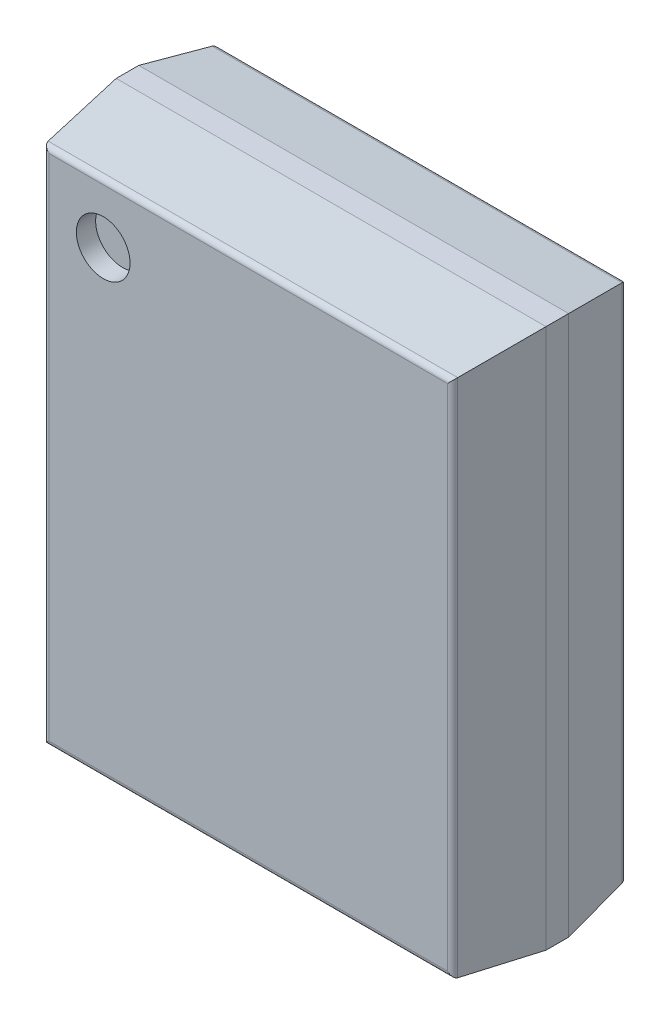
ISO-10303-21;
HEADER;
FILE_DESCRIPTION(('STEP AP214'),'2;1');
FILE_NAME('part.step','',(''),(''),'','','');
FILE_SCHEMA(('AUTOMOTIVE_DESIGN { 1 0 10303 214 1 1 1 1 }'));
ENDSEC;
DATA;
#1=APPLICATION_CONTEXT('core data for automotive mechanical design processes');
#2=APPLICATION_PROTOCOL_DEFINITION('international standard','automotive_design',2000,#1);
#3=PRODUCT_CONTEXT('',#1,'mechanical');
#4=PRODUCT('Part','Part','',(#3));
#5=PRODUCT_RELATED_PRODUCT_CATEGORY('part','',(#4));
#6=PRODUCT_DEFINITION_FORMATION('','',#4);
#7=PRODUCT_DEFINITION_CONTEXT('part definition',#1,'design');
#8=PRODUCT_DEFINITION('design','',#6,#7);
#9=PRODUCT_DEFINITION_SHAPE('','',#8);
#10=(LENGTH_UNIT() NAMED_UNIT(*) SI_UNIT(.MILLI.,.METRE.));
#11=(NAMED_UNIT(*) PLANE_ANGLE_UNIT() SI_UNIT($,.RADIAN.));
#12=(NAMED_UNIT(*) SI_UNIT($,.STERADIAN.) SOLID_ANGLE_UNIT());
#13=UNCERTAINTY_MEASURE_WITH_UNIT(LENGTH_MEASURE(1.E-05),#10,'distance_accuracy_value','');
#14=(GEOMETRIC_REPRESENTATION_CONTEXT(3) GLOBAL_UNCERTAINTY_ASSIGNED_CONTEXT((#13)) GLOBAL_UNIT_ASSIGNED_CONTEXT((#10,
#11,#12)) REPRESENTATION_CONTEXT('',''));
#15=CARTESIAN_POINT('',(0.,0.,0.));
#16=DIRECTION('',(0.,0.,1.));
#17=DIRECTION('',(1.,0.,0.));
#18=AXIS2_PLACEMENT_3D('',#15,#16,#17);
#19=CARTESIAN_POINT('',(-1.315,1.815,1.575));
#20=DIRECTION('',(0.,0.,1.));
#21=DIRECTION('',(1.,0.,0.));
#22=AXIS2_PLACEMENT_3D('',#19,#20,#21);
#23=PLANE('',#22);
#24=CARTESIAN_POINT('',(-1.315,1.815,1.575));
#25=DIRECTION('',(0.,0.,1.));
#26=DIRECTION('',(1.,0.,0.));
#27=AXIS2_PLACEMENT_3D('',#24,#25,#26);
#28=CIRCLE('',#27,0.24375);
#29=CARTESIAN_POINT('',(-1.07125,1.815,1.575));
#30=VERTEX_POINT('',#29);
#31=EDGE_CURVE('E11',#30,#30,#28,.T.);
#32=ORIENTED_EDGE('',*,*,#31,.T.);
#33=EDGE_LOOP('',(#32));
#34=FACE_BOUND('',#33,.T.);
#35=ADVANCED_FACE('F17',(#34),#23,.T.);
#36=CARTESIAN_POINT('',(-1.315,1.815,1.575));
#37=DIRECTION('',(0.,0.,1.));
#38=DIRECTION('',(1.,0.,0.));
#39=AXIS2_PLACEMENT_3D('',#36,#37,#38);
#40=CYLINDRICAL_SURFACE('',#39,0.24375);
#41=CARTESIAN_POINT('',(-1.315,1.815,1.75));
#42=DIRECTION('',(0.,0.,1.));
#43=DIRECTION('',(1.,0.,0.));
#44=AXIS2_PLACEMENT_3D('',#41,#42,#43);
#45=CIRCLE('',#44,0.24375);
#46=CARTESIAN_POINT('',(-1.07125,1.815,1.75));
#47=VERTEX_POINT('',#46);
#48=EDGE_CURVE('E219',#47,#47,#45,.T.);
#49=ORIENTED_EDGE('',*,*,#48,.T.);
#50=EDGE_LOOP('',(#49));
#51=FACE_BOUND('',#50,.T.);
#52=ORIENTED_EDGE('',*,*,#31,.F.);
#53=EDGE_LOOP('',(#52));
#54=FACE_BOUND('',#53,.T.);
#55=ADVANCED_FACE('F19',(#51,#54),#40,.F.);
#56=CARTESIAN_POINT('',(1.808558552786,-2.3525,1.7));
#57=DIRECTION('',(0.,1.,0.));
#58=DIRECTION('',(0.,0.,1.));
#59=AXIS2_PLACEMENT_3D('',#56,#57,#58);
#60=CYLINDRICAL_SURFACE('',#59,0.05);
#61=CARTESIAN_POINT('',(1.808558552786,-2.308558552786,1.7));
#62=DIRECTION('',(-0.707106781186548,-0.707106781186548,0.));
#63=DIRECTION('',(0.707106781186548,-0.707106781186548,0.));
#64=AXIS2_PLACEMENT_3D('',#61,#62,#63);
#65=ELLIPSE('',#64,0.07071067811865,0.05);
#66=CARTESIAN_POINT('',(1.858144342698,-2.358144342698,1.706422572601));
#67=VERTEX_POINT('',#66);
#68=CARTESIAN_POINT('',(1.808558552786,-2.308558552786,1.75));
#69=VERTEX_POINT('',#68);
#70=EDGE_CURVE('E215',#67,#69,#65,.T.);
#71=ORIENTED_EDGE('',*,*,#70,.F.);
#72=DIRECTION('',(0.,1.,0.));
#73=VECTOR('',#72,1.);
#74=CARTESIAN_POINT('',(1.858144342698,-2.3525,1.706422572601));
#75=LINE('',#74,#73);
#76=CARTESIAN_POINT('',(1.858144342698,2.358144342698,1.706422572601));
#77=VERTEX_POINT('',#76);
#78=EDGE_CURVE('E212',#67,#77,#75,.T.);
#79=ORIENTED_EDGE('',*,*,#78,.T.);
#80=CARTESIAN_POINT('',(1.808558552786,2.308558552786,1.7));
#81=DIRECTION('',(-0.707106781186548,0.707106781186548,0.));
#82=DIRECTION('',(0.707106781186548,0.707106781186548,0.));
#83=AXIS2_PLACEMENT_3D('',#80,#81,#82);
#84=ELLIPSE('',#83,0.07071067811865,0.05);
#85=CARTESIAN_POINT('',(1.808558552786,2.308558552786,1.75));
#86=VERTEX_POINT('',#85);
#87=EDGE_CURVE('E21',#86,#77,#84,.T.);
#88=ORIENTED_EDGE('',*,*,#87,.F.);
#89=DIRECTION('',(0.,1.,0.));
#90=VECTOR('',#89,1.);
#91=CARTESIAN_POINT('',(1.808558552786,-2.3525,1.75));
#92=LINE('',#91,#90);
#93=EDGE_CURVE('E45',#69,#86,#92,.T.);
#94=ORIENTED_EDGE('',*,*,#93,.F.);
#95=EDGE_LOOP('',(#71,#79,#88,#94));
#96=FACE_BOUND('',#95,.T.);
#97=ADVANCED_FACE('F377',(#96),#60,.T.);
#98=CARTESIAN_POINT('',(-1.8525,2.308558552786,1.7));
#99=DIRECTION('',(1.,0.,0.));
#100=DIRECTION('',(0.,0.,1.));
#101=AXIS2_PLACEMENT_3D('',#98,#99,#100);
#102=CYLINDRICAL_SURFACE('',#101,0.05);
#103=DIRECTION('',(1.,0.,0.));
#104=VECTOR('',#103,1.);
#105=CARTESIAN_POINT('',(-1.8525,2.308558552786,1.75));
#106=LINE('',#105,#104);
#107=CARTESIAN_POINT('',(-1.808558552786,2.308558552786,1.75));
#108=VERTEX_POINT('',#107);
#109=EDGE_CURVE('E217',#108,#86,#106,.T.);
#110=ORIENTED_EDGE('',*,*,#109,.T.);
#111=ORIENTED_EDGE('',*,*,#87,.T.);
#112=DIRECTION('',(1.,0.,0.));
#113=VECTOR('',#112,1.);
#114=CARTESIAN_POINT('',(-1.8525,2.358144342698,1.706422572601));
#115=LINE('',#114,#113);
#116=CARTESIAN_POINT('',(-1.858144342698,2.358144342698,1.706422572601));
#117=VERTEX_POINT('',#116);
#118=EDGE_CURVE('E204',#117,#77,#115,.T.);
#119=ORIENTED_EDGE('',*,*,#118,.F.);
#120=CARTESIAN_POINT('',(-1.808558552786,2.308558552786,1.7));
#121=DIRECTION('',(0.707106781186548,0.707106781186548,0.));
#122=DIRECTION('',(-0.707106781186548,0.707106781186548,0.));
#123=AXIS2_PLACEMENT_3D('',#120,#121,#122);
#124=ELLIPSE('',#123,0.07071067811865,0.05);
#125=EDGE_CURVE('E174',#117,#108,#124,.T.);
#126=ORIENTED_EDGE('',*,*,#125,.T.);
#127=EDGE_LOOP('',(#110,#111,#119,#126));
#128=FACE_BOUND('',#127,.T.);
#129=ADVANCED_FACE('F379',(#128),#102,.T.);
#130=CARTESIAN_POINT('',(-1.95,-2.45,1.75));
#131=DIRECTION('',(0.,0.,1.));
#132=DIRECTION('',(1.,0.,0.));
#133=AXIS2_PLACEMENT_3D('',#130,#131,#132);
#134=PLANE('',#133);
#135=ORIENTED_EDGE('',*,*,#48,.F.);
#136=EDGE_LOOP('',(#135));
#137=FACE_BOUND('',#136,.T.);
#138=DIRECTION('',(0.,1.,0.));
#139=VECTOR('',#138,1.);
#140=CARTESIAN_POINT('',(-1.808558552786,-2.3525,1.75));
#141=LINE('',#140,#139);
#142=CARTESIAN_POINT('',(-1.808558552786,-2.308558552786,1.75));
#143=VERTEX_POINT('',#142);
#144=EDGE_CURVE('E148',#143,#108,#141,.T.);
#145=ORIENTED_EDGE('',*,*,#144,.F.);
#146=DIRECTION('',(1.,0.,0.));
#147=VECTOR('',#146,1.);
#148=CARTESIAN_POINT('',(-1.8525,-2.308558552786,1.75));
#149=LINE('',#148,#147);
#150=EDGE_CURVE('E142',#143,#69,#149,.T.);
#151=ORIENTED_EDGE('',*,*,#150,.T.);
#152=ORIENTED_EDGE('',*,*,#93,.T.);
#153=ORIENTED_EDGE('',*,*,#109,.F.);
#154=EDGE_LOOP('',(#145,#151,#152,#153));
#155=FACE_BOUND('',#154,.T.);
#156=ADVANCED_FACE('F385',(#137,#155),#134,.T.);
#157=CARTESIAN_POINT('',(-1.8525,-2.308558552786,1.7));
#158=DIRECTION('',(1.,0.,0.));
#159=DIRECTION('',(0.,-0.991715798237691,0.12845145201896));
#160=AXIS2_PLACEMENT_3D('',#157,#158,#159);
#161=CYLINDRICAL_SURFACE('',#160,0.05);
#162=DIRECTION('',(1.,0.,0.));
#163=VECTOR('',#162,1.);
#164=CARTESIAN_POINT('',(-1.8525,-2.358144342698,1.706422572601));
#165=LINE('',#164,#163);
#166=CARTESIAN_POINT('',(-1.858144342698,-2.358144342698,1.706422572601));
#167=VERTEX_POINT('',#166);
#168=EDGE_CURVE('E140',#167,#67,#165,.T.);
#169=ORIENTED_EDGE('',*,*,#168,.T.);
#170=ORIENTED_EDGE('',*,*,#70,.T.);
#171=ORIENTED_EDGE('',*,*,#150,.F.);
#172=CARTESIAN_POINT('',(-1.808558552786,-2.308558552786,1.7));
#173=DIRECTION('',(-0.707106781186548,0.707106781186548,0.));
#174=DIRECTION('',(0.707106781186548,0.707106781186548,0.));
#175=AXIS2_PLACEMENT_3D('',#172,#173,#174);
#176=ELLIPSE('',#175,0.07071067811865,0.05);
#177=EDGE_CURVE('E136',#167,#143,#176,.T.);
#178=ORIENTED_EDGE('',*,*,#177,.F.);
#179=EDGE_LOOP('',(#169,#170,#171,#178));
#180=FACE_BOUND('',#179,.T.);
#181=ADVANCED_FACE('F138',(#180),#161,.T.);
#182=CARTESIAN_POINT('',(1.90125,-2.45,1.373623210137));
#183=DIRECTION('',(0.991715798237691,0.,0.12845145201896));
#184=DIRECTION('',(0.,-1.,0.));
#185=AXIS2_PLACEMENT_3D('',#182,#183,#184);
#186=PLANE('',#185);
#187=DIRECTION('',(-0.12740467794397,0.12740467794397,0.983634127140771));
#188=VECTOR('',#187,1.);
#189=CARTESIAN_POINT('',(1.870389001332,-2.370389001332,1.611887079072));
#190=LINE('',#189,#188);
#191=CARTESIAN_POINT('',(1.95,-2.45,0.997246420274));
#192=VERTEX_POINT('',#191);
#193=EDGE_CURVE('E156',#192,#67,#190,.T.);
#194=ORIENTED_EDGE('',*,*,#193,.F.);
#195=DIRECTION('',(0.,1.,0.));
#196=VECTOR('',#195,1.);
#197=CARTESIAN_POINT('',(1.95,-2.45,0.997246420274));
#198=LINE('',#197,#196);
#199=CARTESIAN_POINT('',(1.95,2.45,0.997246420274));
#200=VERTEX_POINT('',#199);
#201=EDGE_CURVE('E196',#192,#200,#198,.T.);
#202=ORIENTED_EDGE('',*,*,#201,.T.);
#203=DIRECTION('',(-0.12740467794397,-0.12740467794397,0.983634127140771));
#204=VECTOR('',#203,1.);
#205=CARTESIAN_POINT('',(1.830620719025,2.330620719025,1.91892007257));
#206=LINE('',#205,#204);
#207=EDGE_CURVE('E208',#200,#77,#206,.T.);
#208=ORIENTED_EDGE('',*,*,#207,.T.);
#209=ORIENTED_EDGE('',*,*,#78,.F.);
#210=EDGE_LOOP('',(#194,#202,#208,#209));
#211=FACE_BOUND('',#210,.T.);
#212=ADVANCED_FACE('F375',(#211),#186,.T.);
#213=CARTESIAN_POINT('',(-1.95,2.40125,1.373623210137));
#214=DIRECTION('',(0.,0.991715798237691,0.12845145201896));
#215=DIRECTION('',(1.,0.,0.));
#216=AXIS2_PLACEMENT_3D('',#213,#214,#215);
#217=PLANE('',#216);
#218=ORIENTED_EDGE('',*,*,#118,.T.);
#219=ORIENTED_EDGE('',*,*,#207,.F.);
#220=DIRECTION('',(1.,0.,0.));
#221=VECTOR('',#220,1.);
#222=CARTESIAN_POINT('',(-1.95,2.45,0.997246420274));
#223=LINE('',#222,#221);
#224=CARTESIAN_POINT('',(-1.95,2.45,0.997246420274));
#225=VERTEX_POINT('',#224);
#226=EDGE_CURVE('E192',#225,#200,#223,.T.);
#227=ORIENTED_EDGE('',*,*,#226,.F.);
#228=DIRECTION('',(0.12740467794397,-0.12740467794397,0.983634127140771));
#229=VECTOR('',#228,1.);
#230=CARTESIAN_POINT('',(-1.862273025351,2.362273025351,1.674546873663));
#231=LINE('',#230,#229);
#232=EDGE_CURVE('E169',#225,#117,#231,.T.);
#233=ORIENTED_EDGE('',*,*,#232,.T.);
#234=EDGE_LOOP('',(#218,#219,#227,#233));
#235=FACE_BOUND('',#234,.T.);
#236=ADVANCED_FACE('F399',(#235),#217,.T.);
#237=CARTESIAN_POINT('',(-1.808558552786,-2.3525,1.7));
#238=DIRECTION('',(0.,1.,0.));
#239=DIRECTION('',(-0.991715798237691,0.,0.12845145201896));
#240=AXIS2_PLACEMENT_3D('',#237,#238,#239);
#241=CYLINDRICAL_SURFACE('',#240,0.05);
#242=ORIENTED_EDGE('',*,*,#177,.T.);
#243=ORIENTED_EDGE('',*,*,#144,.T.);
#244=ORIENTED_EDGE('',*,*,#125,.F.);
#245=DIRECTION('',(0.,1.,0.));
#246=VECTOR('',#245,1.);
#247=CARTESIAN_POINT('',(-1.858144342698,-2.3525,1.706422572601));
#248=LINE('',#247,#246);
#249=EDGE_CURVE('E164',#167,#117,#248,.T.);
#250=ORIENTED_EDGE('',*,*,#249,.F.);
#251=EDGE_LOOP('',(#242,#243,#244,#250));
#252=FACE_BOUND('',#251,.T.);
#253=ADVANCED_FACE('F172',(#252),#241,.T.);
#254=CARTESIAN_POINT('',(-1.95,-2.40125,1.373623210137));
#255=DIRECTION('',(0.,0.991715798237691,-0.12845145201896));
#256=DIRECTION('',(-1.,0.,0.));
#257=AXIS2_PLACEMENT_3D('',#254,#255,#256);
#258=PLANE('',#257);
#259=DIRECTION('',(0.12740467794397,0.12740467794397,0.983634127140771));
#260=VECTOR('',#259,1.);
#261=CARTESIAN_POINT('',(-1.902041307658,-2.402041307658,1.367513880164));
#262=LINE('',#261,#260);
#263=CARTESIAN_POINT('',(-1.95,-2.45,0.997246420274));
#264=VERTEX_POINT('',#263);
#265=EDGE_CURVE('E154',#264,#167,#262,.T.);
#266=ORIENTED_EDGE('',*,*,#265,.F.);
#267=DIRECTION('',(1.,0.,0.));
#268=VECTOR('',#267,1.);
#269=CARTESIAN_POINT('',(-1.95,-2.45,0.997246420274));
#270=LINE('',#269,#268);
#271=EDGE_CURVE('E269',#264,#192,#270,.T.);
#272=ORIENTED_EDGE('',*,*,#271,.T.);
#273=ORIENTED_EDGE('',*,*,#193,.T.);
#274=ORIENTED_EDGE('',*,*,#168,.F.);
#275=EDGE_LOOP('',(#266,#272,#273,#274));
#276=FACE_BOUND('',#275,.T.);
#277=ADVANCED_FACE('F152',(#276),#258,.F.);
#278=CARTESIAN_POINT('',(1.95,-2.45,0.175));
#279=DIRECTION('',(1.,0.,0.));
#280=DIRECTION('',(0.,1.,0.));
#281=AXIS2_PLACEMENT_3D('',#278,#279,#280);
#282=PLANE('',#281);
#283=DIRECTION('',(0.,0.,1.));
#284=VECTOR('',#283,1.);
#285=CARTESIAN_POINT('',(1.95,-2.45,0.175));
#286=LINE('',#285,#284);
#287=CARTESIAN_POINT('',(1.95,-2.45,0.792246420274));
#288=VERTEX_POINT('',#287);
#289=EDGE_CURVE('E264',#288,#192,#286,.T.);
#290=ORIENTED_EDGE('',*,*,#289,.F.);
#291=DIRECTION('',(0.,1.,0.));
#292=VECTOR('',#291,1.);
#293=CARTESIAN_POINT('',(1.95,-2.45,0.792246420274));
#294=LINE('',#293,#292);
#295=CARTESIAN_POINT('',(1.95,2.45,0.792246420274));
#296=VERTEX_POINT('',#295);
#297=EDGE_CURVE('E314',#288,#296,#294,.T.);
#298=ORIENTED_EDGE('',*,*,#297,.T.);
#299=DIRECTION('',(0.,0.,1.));
#300=VECTOR('',#299,1.);
#301=CARTESIAN_POINT('',(1.95,2.45,0.175));
#302=LINE('',#301,#300);
#303=EDGE_CURVE('E168',#296,#200,#302,.T.);
#304=ORIENTED_EDGE('',*,*,#303,.T.);
#305=ORIENTED_EDGE('',*,*,#201,.F.);
#306=EDGE_LOOP('',(#290,#298,#304,#305));
#307=FACE_BOUND('',#306,.T.);
#308=ADVANCED_FACE('F373',(#307),#282,.T.);
#309=CARTESIAN_POINT('',(1.809778042507,-2.3525,0.225));
#310=DIRECTION('',(0.,1.,0.));
#311=DIRECTION('',(0.,0.,-1.));
#312=AXIS2_PLACEMENT_3D('',#309,#310,#311);
#313=CYLINDRICAL_SURFACE('',#312,0.05);
#314=DIRECTION('',(0.,1.,0.));
#315=VECTOR('',#314,1.);
#316=CARTESIAN_POINT('',(1.809778042507,-2.3525,0.175));
#317=LINE('',#316,#315);
#318=CARTESIAN_POINT('',(1.809778042507,-2.309778042507,0.175));
#319=VERTEX_POINT('',#318);
#320=CARTESIAN_POINT('',(1.809778042507,2.309778042507,0.175));
#321=VERTEX_POINT('',#320);
#322=EDGE_CURVE('E185',#319,#321,#317,.T.);
#323=ORIENTED_EDGE('',*,*,#322,.T.);
#324=CARTESIAN_POINT('',(1.809778042507,2.309778042507,0.225));
#325=DIRECTION('',(0.707106781186548,-0.707106781186548,0.));
#326=DIRECTION('',(0.707106781186548,0.707106781186548,0.));
#327=AXIS2_PLACEMENT_3D('',#324,#325,#326);
#328=ELLIPSE('',#327,0.07071067811865,0.05);
#329=CARTESIAN_POINT('',(1.859165697143,2.359165697143,0.217198745641));
#330=VERTEX_POINT('',#329);
#331=EDGE_CURVE('E177',#321,#330,#328,.T.);
#332=ORIENTED_EDGE('',*,*,#331,.T.);
#333=DIRECTION('',(0.,1.,0.));
#334=VECTOR('',#333,1.);
#335=CARTESIAN_POINT('',(1.859165697143,-2.3525,0.217198745641));
#336=LINE('',#335,#334);
#337=CARTESIAN_POINT('',(1.859165697143,-2.359165697143,0.217198745641));
#338=VERTEX_POINT('',#337);
#339=EDGE_CURVE('E268',#338,#330,#336,.T.);
#340=ORIENTED_EDGE('',*,*,#339,.F.);
#341=CARTESIAN_POINT('',(1.809778042507,-2.309778042507,0.225));
#342=DIRECTION('',(0.707106781186548,0.707106781186548,0.));
#343=DIRECTION('',(0.707106781186548,-0.707106781186548,0.));
#344=AXIS2_PLACEMENT_3D('',#341,#342,#343);
#345=ELLIPSE('',#344,0.07071067811865,0.05);
#346=EDGE_CURVE('E305',#338,#319,#345,.T.);
#347=ORIENTED_EDGE('',*,*,#346,.T.);
#348=EDGE_LOOP('',(#323,#332,#340,#347));
#349=FACE_BOUND('',#348,.T.);
#350=ADVANCED_FACE('F326',(#349),#313,.T.);
#351=CARTESIAN_POINT('',(-1.95,2.45,0.175));
#352=DIRECTION('',(0.,1.,0.));
#353=DIRECTION('',(1.,0.,0.));
#354=AXIS2_PLACEMENT_3D('',#351,#352,#353);
#355=PLANE('',#354);
#356=ORIENTED_EDGE('',*,*,#303,.F.);
#357=DIRECTION('',(1.,0.,0.));
#358=VECTOR('',#357,1.);
#359=CARTESIAN_POINT('',(-1.95,2.45,0.792246420274));
#360=LINE('',#359,#358);
#361=CARTESIAN_POINT('',(-1.95,2.45,0.792246420274));
#362=VERTEX_POINT('',#361);
#363=EDGE_CURVE('E278',#362,#296,#360,.T.);
#364=ORIENTED_EDGE('',*,*,#363,.F.);
#365=DIRECTION('',(0.,0.,1.));
#366=VECTOR('',#365,1.);
#367=CARTESIAN_POINT('',(-1.95,2.45,0.175));
#368=LINE('',#367,#366);
#369=EDGE_CURVE('E237',#362,#225,#368,.T.);
#370=ORIENTED_EDGE('',*,*,#369,.T.);
#371=ORIENTED_EDGE('',*,*,#226,.T.);
#372=EDGE_LOOP('',(#356,#364,#370,#371));
#373=FACE_BOUND('',#372,.T.);
#374=ADVANCED_FACE('F370',(#373),#355,.T.);
#375=CARTESIAN_POINT('',(-1.90125,-2.45,1.373623210137));
#376=DIRECTION('',(0.991715798237691,0.,-0.12845145201896));
#377=DIRECTION('',(0.,-1.,0.));
#378=AXIS2_PLACEMENT_3D('',#375,#376,#377);
#379=PLANE('',#378);
#380=ORIENTED_EDGE('',*,*,#249,.T.);
#381=ORIENTED_EDGE('',*,*,#232,.F.);
#382=DIRECTION('',(0.,1.,0.));
#383=VECTOR('',#382,1.);
#384=CARTESIAN_POINT('',(-1.95,-2.45,0.997246420274));
#385=LINE('',#384,#383);
#386=EDGE_CURVE('E166',#264,#225,#385,.T.);
#387=ORIENTED_EDGE('',*,*,#386,.F.);
#388=ORIENTED_EDGE('',*,*,#265,.T.);
#389=EDGE_LOOP('',(#380,#381,#387,#388));
#390=FACE_BOUND('',#389,.T.);
#391=ADVANCED_FACE('F162',(#390),#379,.F.);
#392=CARTESIAN_POINT('',(-1.8525,2.309778042507,0.225));
#393=DIRECTION('',(1.,0.,0.));
#394=DIRECTION('',(0.,0.,-1.));
#395=AXIS2_PLACEMENT_3D('',#392,#393,#394);
#396=CYLINDRICAL_SURFACE('',#395,0.05);
#397=CARTESIAN_POINT('',(-1.809778042507,2.309778042507,0.225));
#398=DIRECTION('',(-0.707106781186548,-0.707106781186548,0.));
#399=DIRECTION('',(-0.707106781186548,0.707106781186548,0.));
#400=AXIS2_PLACEMENT_3D('',#397,#398,#399);
#401=ELLIPSE('',#400,0.07071067811865,0.05);
#402=CARTESIAN_POINT('',(-1.859165697143,2.359165697143,0.217198745641));
#403=VERTEX_POINT('',#402);
#404=CARTESIAN_POINT('',(-1.809778042507,2.309778042507,0.175));
#405=VERTEX_POINT('',#404);
#406=EDGE_CURVE('E273',#403,#405,#401,.T.);
#407=ORIENTED_EDGE('',*,*,#406,.F.);
#408=DIRECTION('',(1.,0.,0.));
#409=VECTOR('',#408,1.);
#410=CARTESIAN_POINT('',(-1.8525,2.359165697143,0.217198745641));
#411=LINE('',#410,#409);
#412=EDGE_CURVE('E297',#403,#330,#411,.T.);
#413=ORIENTED_EDGE('',*,*,#412,.T.);
#414=ORIENTED_EDGE('',*,*,#331,.F.);
#415=DIRECTION('',(1.,0.,0.));
#416=VECTOR('',#415,1.);
#417=CARTESIAN_POINT('',(-1.8525,2.309778042507,0.175));
#418=LINE('',#417,#416);
#419=EDGE_CURVE('E318',#405,#321,#418,.T.);
#420=ORIENTED_EDGE('',*,*,#419,.F.);
#421=EDGE_LOOP('',(#407,#413,#414,#420));
#422=FACE_BOUND('',#421,.T.);
#423=ADVANCED_FACE('F333',(#422),#396,.T.);
#424=CARTESIAN_POINT('',(-1.95,-2.45,0.175));
#425=DIRECTION('',(0.,0.,1.));
#426=DIRECTION('',(1.,0.,0.));
#427=AXIS2_PLACEMENT_3D('',#424,#425,#426);
#428=PLANE('',#427);
#429=ORIENTED_EDGE('',*,*,#419,.T.);
#430=ORIENTED_EDGE('',*,*,#322,.F.);
#431=DIRECTION('',(1.,0.,0.));
#432=VECTOR('',#431,1.);
#433=CARTESIAN_POINT('',(-1.8525,-2.309778042507,0.175));
#434=LINE('',#433,#432);
#435=CARTESIAN_POINT('',(-1.809778042507,-2.309778042507,0.175));
#436=VERTEX_POINT('',#435);
#437=EDGE_CURVE('E301',#436,#319,#434,.T.);
#438=ORIENTED_EDGE('',*,*,#437,.F.);
#439=DIRECTION('',(0.,1.,0.));
#440=VECTOR('',#439,1.);
#441=CARTESIAN_POINT('',(-1.809778042507,-2.3525,0.175));
#442=LINE('',#441,#440);
#443=EDGE_CURVE('E258',#436,#405,#442,.T.);
#444=ORIENTED_EDGE('',*,*,#443,.T.);
#445=EDGE_LOOP('',(#429,#430,#438,#444));
#446=FACE_BOUND('',#445,.T.);
#447=ADVANCED_FACE('F329',(#446),#428,.F.);
#448=CARTESIAN_POINT('',(1.90125,-2.45,0.483623210137));
#449=DIRECTION('',(-0.987753092714965,0.,0.156025087187994));
#450=DIRECTION('',(0.,1.,0.));
#451=AXIS2_PLACEMENT_3D('',#448,#449,#450);
#452=PLANE('',#451);
#453=ORIENTED_EDGE('',*,*,#339,.T.);
#454=DIRECTION('',(-0.154159948465985,-0.154159948465985,-0.975945398358909));
#455=VECTOR('',#454,1.);
#456=CARTESIAN_POINT('',(1.797841283145,2.297841283145,-0.171029716054));
#457=LINE('',#456,#455);
#458=EDGE_CURVE('E285',#296,#330,#457,.T.);
#459=ORIENTED_EDGE('',*,*,#458,.F.);
#460=ORIENTED_EDGE('',*,*,#297,.F.);
#461=DIRECTION('',(-0.154159948465985,0.154159948465985,-0.975945398358909));
#462=VECTOR('',#461,1.);
#463=CARTESIAN_POINT('',(1.856066242937,-2.356066242937,0.197576930121));
#464=LINE('',#463,#462);
#465=EDGE_CURVE('E246',#288,#338,#464,.T.);
#466=ORIENTED_EDGE('',*,*,#465,.T.);
#467=EDGE_LOOP('',(#453,#459,#460,#466));
#468=FACE_BOUND('',#467,.T.);
#469=ADVANCED_FACE('F339',(#468),#452,.F.);
#470=CARTESIAN_POINT('',(-1.95,-2.45,0.175));
#471=DIRECTION('',(0.,1.,0.));
#472=DIRECTION('',(1.,0.,0.));
#473=AXIS2_PLACEMENT_3D('',#470,#471,#472);
#474=PLANE('',#473);
#475=ORIENTED_EDGE('',*,*,#271,.F.);
#476=DIRECTION('',(0.,0.,1.));
#477=VECTOR('',#476,1.);
#478=CARTESIAN_POINT('',(-1.95,-2.45,0.175));
#479=LINE('',#478,#477);
#480=CARTESIAN_POINT('',(-1.95,-2.45,0.792246420274));
#481=VERTEX_POINT('',#480);
#482=EDGE_CURVE('E274',#481,#264,#479,.T.);
#483=ORIENTED_EDGE('',*,*,#482,.F.);
#484=DIRECTION('',(1.,0.,0.));
#485=VECTOR('',#484,1.);
#486=CARTESIAN_POINT('',(-1.95,-2.45,0.792246420274));
#487=LINE('',#486,#485);
#488=EDGE_CURVE('E250',#481,#288,#487,.T.);
#489=ORIENTED_EDGE('',*,*,#488,.T.);
#490=ORIENTED_EDGE('',*,*,#289,.T.);
#491=EDGE_LOOP('',(#475,#483,#489,#490));
#492=FACE_BOUND('',#491,.T.);
#493=ADVANCED_FACE('F367',(#492),#474,.F.);
#494=CARTESIAN_POINT('',(-1.8525,-2.309778042507,0.225));
#495=DIRECTION('',(1.,0.,0.));
#496=DIRECTION('',(0.,-0.987753092714965,-0.156025087187994));
#497=AXIS2_PLACEMENT_3D('',#494,#495,#496);
#498=CYLINDRICAL_SURFACE('',#497,0.05);
#499=CARTESIAN_POINT('',(-1.809778042507,-2.309778042507,0.225));
#500=DIRECTION('',(0.707106781186548,-0.707106781186548,0.));
#501=DIRECTION('',(0.707106781186548,0.707106781186548,0.));
#502=AXIS2_PLACEMENT_3D('',#499,#500,#501);
#503=ELLIPSE('',#502,0.07071067811865,0.05);
#504=CARTESIAN_POINT('',(-1.859165697143,-2.359165697143,0.217198745641));
#505=VERTEX_POINT('',#504);
#506=EDGE_CURVE('E238',#505,#436,#503,.T.);
#507=ORIENTED_EDGE('',*,*,#506,.T.);
#508=ORIENTED_EDGE('',*,*,#437,.T.);
#509=ORIENTED_EDGE('',*,*,#346,.F.);
#510=DIRECTION('',(1.,0.,0.));
#511=VECTOR('',#510,1.);
#512=CARTESIAN_POINT('',(-1.8525,-2.359165697143,0.217198745641));
#513=LINE('',#512,#511);
#514=EDGE_CURVE('E251',#505,#338,#513,.T.);
#515=ORIENTED_EDGE('',*,*,#514,.F.);
#516=EDGE_LOOP('',(#507,#508,#509,#515));
#517=FACE_BOUND('',#516,.T.);
#518=ADVANCED_FACE('F344',(#517),#498,.T.);
#519=CARTESIAN_POINT('',(-1.95,2.40125,0.483623210137));
#520=DIRECTION('',(0.,-0.987753092714965,0.156025087187994));
#521=DIRECTION('',(-1.,0.,0.));
#522=AXIS2_PLACEMENT_3D('',#519,#520,#521);
#523=PLANE('',#522);
#524=DIRECTION('',(0.154159948465985,-0.154159948465985,-0.975945398358909));
#525=VECTOR('',#524,1.);
#526=CARTESIAN_POINT('',(-1.844183598082,2.344183598082,0.122351083963));
#527=LINE('',#526,#525);
#528=EDGE_CURVE('E241',#362,#403,#527,.T.);
#529=ORIENTED_EDGE('',*,*,#528,.F.);
#530=ORIENTED_EDGE('',*,*,#363,.T.);
#531=ORIENTED_EDGE('',*,*,#458,.T.);
#532=ORIENTED_EDGE('',*,*,#412,.F.);
#533=EDGE_LOOP('',(#529,#530,#531,#532));
#534=FACE_BOUND('',#533,.T.);
#535=ADVANCED_FACE('F337',(#534),#523,.F.);
#536=CARTESIAN_POINT('',(-1.95,-2.45,0.175));
#537=DIRECTION('',(1.,0.,0.));
#538=DIRECTION('',(0.,1.,0.));
#539=AXIS2_PLACEMENT_3D('',#536,#537,#538);
#540=PLANE('',#539);
#541=ORIENTED_EDGE('',*,*,#386,.T.);
#542=ORIENTED_EDGE('',*,*,#369,.F.);
#543=DIRECTION('',(0.,1.,0.));
#544=VECTOR('',#543,1.);
#545=CARTESIAN_POINT('',(-1.95,-2.45,0.792246420274));
#546=LINE('',#545,#544);
#547=EDGE_CURVE('E233',#481,#362,#546,.T.);
#548=ORIENTED_EDGE('',*,*,#547,.F.);
#549=ORIENTED_EDGE('',*,*,#482,.T.);
#550=EDGE_LOOP('',(#541,#542,#548,#549));
#551=FACE_BOUND('',#550,.T.);
#552=ADVANCED_FACE('F368',(#551),#540,.F.);
#553=CARTESIAN_POINT('',(-1.809778042507,-2.3525,0.225));
#554=DIRECTION('',(0.,1.,0.));
#555=DIRECTION('',(-0.987753092714965,0.,-0.156025087187994));
#556=AXIS2_PLACEMENT_3D('',#553,#554,#555);
#557=CYLINDRICAL_SURFACE('',#556,0.05);
#558=DIRECTION('',(0.,1.,0.));
#559=VECTOR('',#558,1.);
#560=CARTESIAN_POINT('',(-1.859165697143,-2.3525,0.217198745641));
#561=LINE('',#560,#559);
#562=EDGE_CURVE('E245',#505,#403,#561,.T.);
#563=ORIENTED_EDGE('',*,*,#562,.T.);
#564=ORIENTED_EDGE('',*,*,#406,.T.);
#565=ORIENTED_EDGE('',*,*,#443,.F.);
#566=ORIENTED_EDGE('',*,*,#506,.F.);
#567=EDGE_LOOP('',(#563,#564,#565,#566));
#568=FACE_BOUND('',#567,.T.);
#569=ADVANCED_FACE('F347',(#568),#557,.T.);
#570=CARTESIAN_POINT('',(-1.95,-2.40125,0.483623210137));
#571=DIRECTION('',(0.,-0.987753092714965,-0.156025087187994));
#572=DIRECTION('',(0.,0.156025087187994,-0.987753092714965));
#573=AXIS2_PLACEMENT_3D('',#570,#571,#572);
#574=PLANE('',#573);
#575=ORIENTED_EDGE('',*,*,#514,.T.);
#576=ORIENTED_EDGE('',*,*,#465,.F.);
#577=ORIENTED_EDGE('',*,*,#488,.F.);
#578=DIRECTION('',(0.154159948465985,0.154159948465985,-0.975945398358909));
#579=VECTOR('',#578,1.);
#580=CARTESIAN_POINT('',(-1.902408557873,-2.402408557873,0.490957730138));
#581=LINE('',#580,#579);
#582=EDGE_CURVE('E354',#481,#505,#581,.T.);
#583=ORIENTED_EDGE('',*,*,#582,.T.);
#584=EDGE_LOOP('',(#575,#576,#577,#583));
#585=FACE_BOUND('',#584,.T.);
#586=ADVANCED_FACE('F365',(#585),#574,.T.);
#587=CARTESIAN_POINT('',(-1.90125,-2.45,0.483623210137));
#588=DIRECTION('',(-0.987753092714965,0.,-0.156025087187994));
#589=DIRECTION('',(-0.156025087187994,0.,0.987753092714965));
#590=AXIS2_PLACEMENT_3D('',#587,#588,#589);
#591=PLANE('',#590);
#592=ORIENTED_EDGE('',*,*,#582,.F.);
#593=ORIENTED_EDGE('',*,*,#547,.T.);
#594=ORIENTED_EDGE('',*,*,#528,.T.);
#595=ORIENTED_EDGE('',*,*,#562,.F.);
#596=EDGE_LOOP('',(#592,#593,#594,#595));
#597=FACE_BOUND('',#596,.T.);
#598=ADVANCED_FACE('F352',(#597),#591,.T.);
#599=CLOSED_SHELL('',(#35,#55,#97,#129,#156,#181,#212,#236,#253,#277,#308,#350,#374,#391,#423,
#447,#469,#493,#518,#535,#552,#569,#586,#598));
#600=MANIFOLD_SOLID_BREP('B1',#599);
#601=ADVANCED_BREP_SHAPE_REPRESENTATION('',(#18,#600),#14);
#602=SHAPE_DEFINITION_REPRESENTATION(#9,#601);
ENDSEC;
END-ISO-10303-21;
